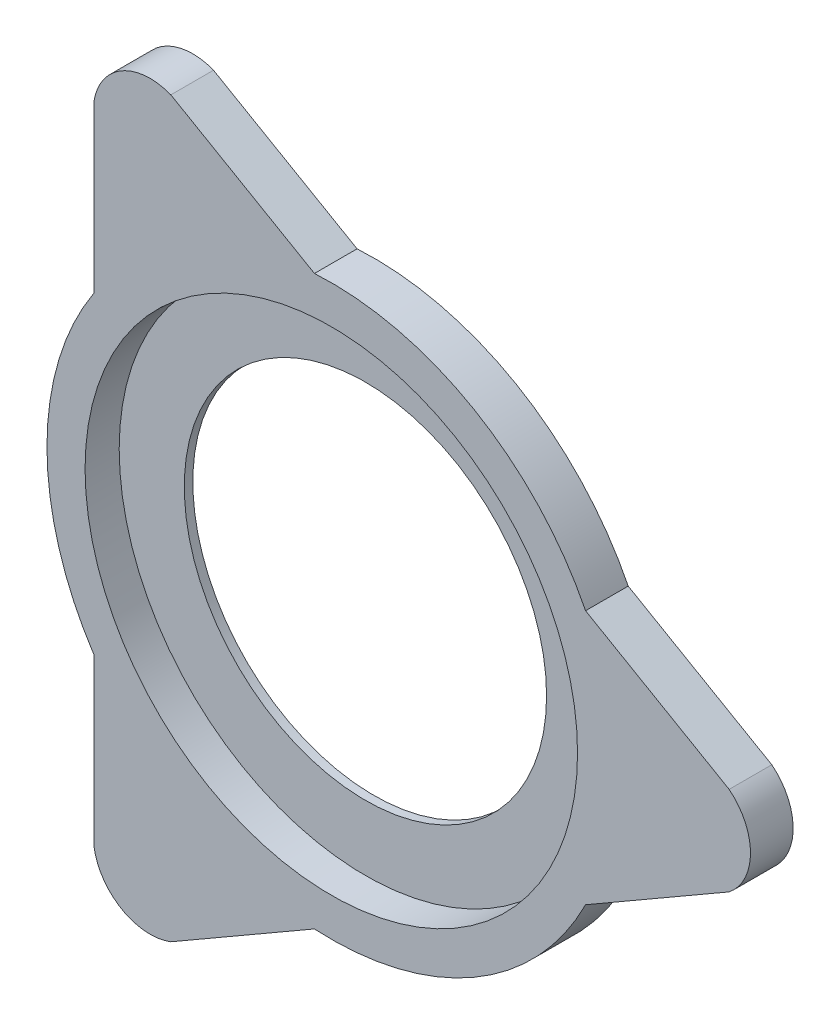
ISO-10303-21;
HEADER;
FILE_DESCRIPTION(('STEP AP214'),'2;1');
FILE_NAME('part.step','',(''),(''),'','','');
FILE_SCHEMA(('AUTOMOTIVE_DESIGN { 1 0 10303 214 1 1 1 1 }'));
ENDSEC;
DATA;
#1=APPLICATION_CONTEXT('core data for automotive mechanical design processes');
#2=APPLICATION_PROTOCOL_DEFINITION('international standard','automotive_design',2000,#1);
#3=PRODUCT_CONTEXT('',#1,'mechanical');
#4=PRODUCT('Part','Part','',(#3));
#5=PRODUCT_RELATED_PRODUCT_CATEGORY('part','',(#4));
#6=PRODUCT_DEFINITION_FORMATION('','',#4);
#7=PRODUCT_DEFINITION_CONTEXT('part definition',#1,'design');
#8=PRODUCT_DEFINITION('design','',#6,#7);
#9=PRODUCT_DEFINITION_SHAPE('','',#8);
#10=(LENGTH_UNIT() NAMED_UNIT(*) SI_UNIT(.MILLI.,.METRE.));
#11=(NAMED_UNIT(*) PLANE_ANGLE_UNIT() SI_UNIT($,.RADIAN.));
#12=(NAMED_UNIT(*) SI_UNIT($,.STERADIAN.) SOLID_ANGLE_UNIT());
#13=UNCERTAINTY_MEASURE_WITH_UNIT(LENGTH_MEASURE(1.E-05),#10,'distance_accuracy_value','');
#14=(GEOMETRIC_REPRESENTATION_CONTEXT(3) GLOBAL_UNCERTAINTY_ASSIGNED_CONTEXT((#13)) GLOBAL_UNIT_ASSIGNED_CONTEXT((#10,
#11,#12)) REPRESENTATION_CONTEXT('',''));
#15=CARTESIAN_POINT('',(0.,0.,0.));
#16=DIRECTION('',(0.,0.,1.));
#17=DIRECTION('',(1.,0.,0.));
#18=AXIS2_PLACEMENT_3D('',#15,#16,#17);
#19=CARTESIAN_POINT('',(0.,0.,9.525));
#20=DIRECTION('',(0.,0.,-1.));
#21=DIRECTION('',(-1.,0.,0.));
#22=AXIS2_PLACEMENT_3D('',#19,#20,#21);
#23=CYLINDRICAL_SURFACE('',#22,40.4563947467404);
#24=CARTESIAN_POINT('',(0.,0.,0.));
#25=DIRECTION('',(0.,0.,1.));
#26=DIRECTION('',(1.,0.,0.));
#27=AXIS2_PLACEMENT_3D('',#24,#25,#26);
#28=CIRCLE('',#27,40.4563947467404);
#29=CARTESIAN_POINT('',(40.4563947467404,0.,0.));
#30=VERTEX_POINT('',#29);
#31=EDGE_CURVE('E159',#30,#30,#28,.T.);
#32=ORIENTED_EDGE('',*,*,#31,.F.);
#33=EDGE_LOOP('',(#32));
#34=FACE_BOUND('',#33,.T.);
#35=CARTESIAN_POINT('',(0.,0.,1.905));
#36=DIRECTION('',(0.,0.,1.));
#37=DIRECTION('',(1.,0.,0.));
#38=AXIS2_PLACEMENT_3D('',#35,#36,#37);
#39=CIRCLE('',#38,40.4563947467404);
#40=CARTESIAN_POINT('',(40.4563947467404,0.,1.905));
#41=VERTEX_POINT('',#40);
#42=EDGE_CURVE('E37',#41,#41,#39,.T.);
#43=ORIENTED_EDGE('',*,*,#42,.T.);
#44=EDGE_LOOP('',(#43));
#45=FACE_BOUND('',#44,.T.);
#46=ADVANCED_FACE('F33',(#34,#45),#23,.F.);
#47=CARTESIAN_POINT('',(0.,0.,9.525));
#48=DIRECTION('',(0.,0.,1.));
#49=DIRECTION('',(1.,0.,0.));
#50=AXIS2_PLACEMENT_3D('',#47,#48,#49);
#51=PLANE('',#50);
#52=CARTESIAN_POINT('',(0.,0.,9.525));
#53=DIRECTION('',(0.,0.,1.));
#54=DIRECTION('',(1.,0.,0.));
#55=AXIS2_PLACEMENT_3D('',#52,#53,#54);
#56=CIRCLE('',#55,54.9919447217432);
#57=CARTESIAN_POINT('',(54.9919447217432,0.,9.525));
#58=VERTEX_POINT('',#57);
#59=EDGE_CURVE('E348',#58,#58,#56,.T.);
#60=ORIENTED_EDGE('',*,*,#59,.F.);
#61=EDGE_LOOP('',(#60));
#62=FACE_BOUND('',#61,.T.);
#63=CARTESIAN_POINT('',(0.,0.,9.525));
#64=DIRECTION('',(0.,0.,1.));
#65=DIRECTION('',(1.,0.,0.));
#66=AXIS2_PLACEMENT_3D('',#63,#64,#65);
#67=CIRCLE('',#66,63.5);
#68=CARTESIAN_POINT('',(56.7796058709401,28.4310808296257,9.525));
#69=VERTEX_POINT('',#68);
#70=CARTESIAN_POINT('',(-3.76776467996547,63.388121515915,9.525));
#71=VERTEX_POINT('',#70);
#72=EDGE_CURVE('E178',#69,#71,#67,.T.);
#73=ORIENTED_EDGE('',*,*,#72,.T.);
#74=DIRECTION('',(-0.866025403784439,0.5,0.));
#75=VECTOR('',#74,1.);
#76=CARTESIAN_POINT('',(-3.76776467996547,63.388121515915,9.525));
#77=LINE('',#76,#75);
#78=CARTESIAN_POINT('',(-35.8333840191295,81.9012154731134,9.525));
#79=VERTEX_POINT('',#78);
#80=EDGE_CURVE('E106',#71,#79,#77,.T.);
#81=ORIENTED_EDGE('',*,*,#80,.T.);
#82=CARTESIAN_POINT('',(-40.4563947467404,70.072531192417,9.525));
#83=DIRECTION('',(0.,0.,1.));
#84=DIRECTION('',(-1.,0.,0.));
#85=AXIS2_PLACEMENT_3D('',#82,#83,#84);
#86=CIRCLE('',#85,12.7);
#87=CARTESIAN_POINT('',(-53.0118411909746,71.983228600686,9.525));
#88=VERTEX_POINT('',#87);
#89=EDGE_CURVE('E206',#79,#88,#86,.T.);
#90=ORIENTED_EDGE('',*,*,#89,.T.);
#91=DIRECTION('',(0.,-1.,0.));
#92=VECTOR('',#91,1.);
#93=CARTESIAN_POINT('',(-53.0118411909746,71.983228600686,9.525));
#94=LINE('',#93,#92);
#95=CARTESIAN_POINT('',(-53.0118411909746,34.9570406862893,9.525));
#96=VERTEX_POINT('',#95);
#97=EDGE_CURVE('E225',#88,#96,#94,.T.);
#98=ORIENTED_EDGE('',*,*,#97,.T.);
#99=CARTESIAN_POINT('',(0.,0.,9.525));
#100=DIRECTION('',(0.,0.,1.));
#101=DIRECTION('',(1.,0.,0.));
#102=AXIS2_PLACEMENT_3D('',#99,#100,#101);
#103=CIRCLE('',#102,63.5);
#104=CARTESIAN_POINT('',(-53.0118411909746,-34.9570406862893,9.525));
#105=VERTEX_POINT('',#104);
#106=EDGE_CURVE('E222',#96,#105,#103,.T.);
#107=ORIENTED_EDGE('',*,*,#106,.T.);
#108=DIRECTION('',(0.,-1.,0.));
#109=VECTOR('',#108,1.);
#110=CARTESIAN_POINT('',(-53.0118411909746,-34.9570406862893,9.525));
#111=LINE('',#110,#109);
#112=CARTESIAN_POINT('',(-53.0118411909746,-71.9832286006861,9.525));
#113=VERTEX_POINT('',#112);
#114=EDGE_CURVE('E224',#105,#113,#111,.T.);
#115=ORIENTED_EDGE('',*,*,#114,.T.);
#116=CARTESIAN_POINT('',(-40.4563947467404,-70.072531192417,9.525));
#117=DIRECTION('',(0.,0.,1.));
#118=DIRECTION('',(-1.,0.,0.));
#119=AXIS2_PLACEMENT_3D('',#116,#117,#118);
#120=CIRCLE('',#119,12.7);
#121=CARTESIAN_POINT('',(-35.8333840191293,-81.9012154731134,9.525));
#122=VERTEX_POINT('',#121);
#123=EDGE_CURVE('E227',#113,#122,#120,.T.);
#124=ORIENTED_EDGE('',*,*,#123,.T.);
#125=DIRECTION('',(0.866025403784438,0.500000000000001,0.));
#126=VECTOR('',#125,1.);
#127=CARTESIAN_POINT('',(-3.76776467996543,-63.388121515915,9.525));
#128=LINE('',#127,#126);
#129=CARTESIAN_POINT('',(-3.76776467996544,-63.388121515915,9.525));
#130=VERTEX_POINT('',#129);
#131=EDGE_CURVE('E233',#122,#130,#128,.T.);
#132=ORIENTED_EDGE('',*,*,#131,.T.);
#133=CARTESIAN_POINT('',(0.,0.,9.525));
#134=DIRECTION('',(0.,0.,1.));
#135=DIRECTION('',(1.,0.,0.));
#136=AXIS2_PLACEMENT_3D('',#133,#134,#135);
#137=CIRCLE('',#136,63.5);
#138=CARTESIAN_POINT('',(56.7796058709401,-28.4310808296256,9.525));
#139=VERTEX_POINT('',#138);
#140=EDGE_CURVE('E137',#130,#139,#137,.T.);
#141=ORIENTED_EDGE('',*,*,#140,.T.);
#142=DIRECTION('',(0.866025403784438,0.500000000000001,0.));
#143=VECTOR('',#142,1.);
#144=CARTESIAN_POINT('',(88.8452252101041,-9.9179868724272,9.525));
#145=LINE('',#144,#143);
#146=CARTESIAN_POINT('',(88.8452252101041,-9.91798687242719,9.525));
#147=VERTEX_POINT('',#146);
#148=EDGE_CURVE('E131',#139,#147,#145,.T.);
#149=ORIENTED_EDGE('',*,*,#148,.T.);
#150=CARTESIAN_POINT('',(80.9127894934808,0.,9.525));
#151=DIRECTION('',(0.,0.,1.));
#152=DIRECTION('',(-1.,0.,0.));
#153=AXIS2_PLACEMENT_3D('',#150,#151,#152);
#154=CIRCLE('',#153,12.7);
#155=CARTESIAN_POINT('',(88.845225210104,9.91798687242733,9.525));
#156=VERTEX_POINT('',#155);
#157=EDGE_CURVE('E135',#147,#156,#154,.T.);
#158=ORIENTED_EDGE('',*,*,#157,.T.);
#159=DIRECTION('',(-0.866025403784439,0.5,0.));
#160=VECTOR('',#159,1.);
#161=CARTESIAN_POINT('',(88.845225210104,9.91798687242733,9.525));
#162=LINE('',#161,#160);
#163=EDGE_CURVE('E51',#156,#69,#162,.T.);
#164=ORIENTED_EDGE('',*,*,#163,.T.);
#165=EDGE_LOOP('',(#73,#81,#90,#98,#107,#115,#124,#132,#141,#149,#158,#164));
#166=FACE_BOUND('',#165,.T.);
#167=ADVANCED_FACE('F133',(#62,#166),#51,.T.);
#168=CARTESIAN_POINT('',(0.,0.,0.));
#169=DIRECTION('',(0.,0.,1.));
#170=DIRECTION('',(1.,0.,0.));
#171=AXIS2_PLACEMENT_3D('',#168,#169,#170);
#172=PLANE('',#171);
#173=CARTESIAN_POINT('',(0.,0.,0.));
#174=DIRECTION('',(0.,0.,1.));
#175=DIRECTION('',(1.,0.,0.));
#176=AXIS2_PLACEMENT_3D('',#173,#174,#175);
#177=CIRCLE('',#176,63.5);
#178=CARTESIAN_POINT('',(56.7796058709401,28.4310808296257,0.));
#179=VERTEX_POINT('',#178);
#180=CARTESIAN_POINT('',(-3.76776467996547,63.388121515915,0.));
#181=VERTEX_POINT('',#180);
#182=EDGE_CURVE('E155',#179,#181,#177,.T.);
#183=ORIENTED_EDGE('',*,*,#182,.F.);
#184=DIRECTION('',(-0.866025403784439,0.5,0.));
#185=VECTOR('',#184,1.);
#186=CARTESIAN_POINT('',(88.845225210104,9.91798687242733,0.));
#187=LINE('',#186,#185);
#188=CARTESIAN_POINT('',(88.845225210104,9.91798687242733,0.));
#189=VERTEX_POINT('',#188);
#190=EDGE_CURVE('E98',#189,#179,#187,.T.);
#191=ORIENTED_EDGE('',*,*,#190,.F.);
#192=CARTESIAN_POINT('',(80.9127894934808,0.,0.));
#193=DIRECTION('',(0.,0.,1.));
#194=DIRECTION('',(-1.,0.,0.));
#195=AXIS2_PLACEMENT_3D('',#192,#193,#194);
#196=CIRCLE('',#195,12.7);
#197=CARTESIAN_POINT('',(88.8452252101041,-9.91798687242719,0.));
#198=VERTEX_POINT('',#197);
#199=EDGE_CURVE('E92',#198,#189,#196,.T.);
#200=ORIENTED_EDGE('',*,*,#199,.F.);
#201=DIRECTION('',(0.866025403784438,0.500000000000001,0.));
#202=VECTOR('',#201,1.);
#203=CARTESIAN_POINT('',(88.8452252101041,-9.9179868724272,0.));
#204=LINE('',#203,#202);
#205=CARTESIAN_POINT('',(56.7796058709401,-28.4310808296256,0.));
#206=VERTEX_POINT('',#205);
#207=EDGE_CURVE('E145',#206,#198,#204,.T.);
#208=ORIENTED_EDGE('',*,*,#207,.F.);
#209=CARTESIAN_POINT('',(0.,0.,0.));
#210=DIRECTION('',(0.,0.,1.));
#211=DIRECTION('',(1.,0.,0.));
#212=AXIS2_PLACEMENT_3D('',#209,#210,#211);
#213=CIRCLE('',#212,63.5);
#214=CARTESIAN_POINT('',(-3.76776467996544,-63.388121515915,0.));
#215=VERTEX_POINT('',#214);
#216=EDGE_CURVE('E173',#215,#206,#213,.T.);
#217=ORIENTED_EDGE('',*,*,#216,.F.);
#218=DIRECTION('',(0.866025403784438,0.500000000000001,0.));
#219=VECTOR('',#218,1.);
#220=CARTESIAN_POINT('',(-3.76776467996543,-63.388121515915,0.));
#221=LINE('',#220,#219);
#222=CARTESIAN_POINT('',(-35.8333840191293,-81.9012154731134,0.));
#223=VERTEX_POINT('',#222);
#224=EDGE_CURVE('E171',#223,#215,#221,.T.);
#225=ORIENTED_EDGE('',*,*,#224,.F.);
#226=CARTESIAN_POINT('',(-40.4563947467404,-70.072531192417,0.));
#227=DIRECTION('',(0.,0.,1.));
#228=DIRECTION('',(-1.,0.,0.));
#229=AXIS2_PLACEMENT_3D('',#226,#227,#228);
#230=CIRCLE('',#229,12.7);
#231=CARTESIAN_POINT('',(-53.0118411909746,-71.9832286006861,0.));
#232=VERTEX_POINT('',#231);
#233=EDGE_CURVE('E169',#232,#223,#230,.T.);
#234=ORIENTED_EDGE('',*,*,#233,.F.);
#235=DIRECTION('',(0.,-1.,0.));
#236=VECTOR('',#235,1.);
#237=CARTESIAN_POINT('',(-53.0118411909746,-34.9570406862893,0.));
#238=LINE('',#237,#236);
#239=CARTESIAN_POINT('',(-53.0118411909746,-34.9570406862893,0.));
#240=VERTEX_POINT('',#239);
#241=EDGE_CURVE('E167',#240,#232,#238,.T.);
#242=ORIENTED_EDGE('',*,*,#241,.F.);
#243=CARTESIAN_POINT('',(0.,0.,0.));
#244=DIRECTION('',(0.,0.,1.));
#245=DIRECTION('',(1.,0.,0.));
#246=AXIS2_PLACEMENT_3D('',#243,#244,#245);
#247=CIRCLE('',#246,63.5);
#248=CARTESIAN_POINT('',(-53.0118411909746,34.9570406862893,0.));
#249=VERTEX_POINT('',#248);
#250=EDGE_CURVE('E165',#249,#240,#247,.T.);
#251=ORIENTED_EDGE('',*,*,#250,.F.);
#252=DIRECTION('',(0.,-1.,0.));
#253=VECTOR('',#252,1.);
#254=CARTESIAN_POINT('',(-53.0118411909746,71.983228600686,0.));
#255=LINE('',#254,#253);
#256=CARTESIAN_POINT('',(-53.0118411909746,71.983228600686,0.));
#257=VERTEX_POINT('',#256);
#258=EDGE_CURVE('E163',#257,#249,#255,.T.);
#259=ORIENTED_EDGE('',*,*,#258,.F.);
#260=CARTESIAN_POINT('',(-40.4563947467404,70.072531192417,0.));
#261=DIRECTION('',(0.,0.,1.));
#262=DIRECTION('',(-1.,0.,0.));
#263=AXIS2_PLACEMENT_3D('',#260,#261,#262);
#264=CIRCLE('',#263,12.7);
#265=CARTESIAN_POINT('',(-35.8333840191295,81.9012154731134,0.));
#266=VERTEX_POINT('',#265);
#267=EDGE_CURVE('E161',#266,#257,#264,.T.);
#268=ORIENTED_EDGE('',*,*,#267,.F.);
#269=DIRECTION('',(-0.866025403784439,0.5,0.));
#270=VECTOR('',#269,1.);
#271=CARTESIAN_POINT('',(-3.76776467996547,63.388121515915,0.));
#272=LINE('',#271,#270);
#273=EDGE_CURVE('E158',#181,#266,#272,.T.);
#274=ORIENTED_EDGE('',*,*,#273,.F.);
#275=EDGE_LOOP('',(#183,#191,#200,#208,#217,#225,#234,#242,#251,#259,#268,#274));
#276=FACE_BOUND('',#275,.T.);
#277=ORIENTED_EDGE('',*,*,#31,.T.);
#278=EDGE_LOOP('',(#277));
#279=FACE_BOUND('',#278,.T.);
#280=ADVANCED_FACE('F210',(#276,#279),#172,.F.);
#281=CARTESIAN_POINT('',(0.,0.,9.525));
#282=DIRECTION('',(0.,0.,-1.));
#283=DIRECTION('',(-1.,0.,0.));
#284=AXIS2_PLACEMENT_3D('',#281,#282,#283);
#285=CYLINDRICAL_SURFACE('',#284,63.5);
#286=ORIENTED_EDGE('',*,*,#182,.T.);
#287=DIRECTION('',(0.,0.,-1.));
#288=VECTOR('',#287,1.);
#289=CARTESIAN_POINT('',(-3.76776467996547,63.388121515915,9.525));
#290=LINE('',#289,#288);
#291=EDGE_CURVE('E11',#71,#181,#290,.T.);
#292=ORIENTED_EDGE('',*,*,#291,.F.);
#293=ORIENTED_EDGE('',*,*,#72,.F.);
#294=DIRECTION('',(0.,0.,-1.));
#295=VECTOR('',#294,1.);
#296=CARTESIAN_POINT('',(56.7796058709401,28.4310808296257,9.525));
#297=LINE('',#296,#295);
#298=EDGE_CURVE('E151',#69,#179,#297,.T.);
#299=ORIENTED_EDGE('',*,*,#298,.T.);
#300=EDGE_LOOP('',(#286,#292,#293,#299));
#301=FACE_BOUND('',#300,.T.);
#302=ADVANCED_FACE('F35',(#301),#285,.T.);
#303=CARTESIAN_POINT('',(-3.76776467996547,63.388121515915,9.525));
#304=DIRECTION('',(-0.5,-0.866025403784439,0.));
#305=DIRECTION('',(0.866025403784439,-0.5,0.));
#306=AXIS2_PLACEMENT_3D('',#303,#304,#305);
#307=PLANE('',#306);
#308=ORIENTED_EDGE('',*,*,#273,.T.);
#309=DIRECTION('',(0.,0.,-1.));
#310=VECTOR('',#309,1.);
#311=CARTESIAN_POINT('',(-35.8333840191295,81.9012154731134,9.525));
#312=LINE('',#311,#310);
#313=EDGE_CURVE('E43',#79,#266,#312,.T.);
#314=ORIENTED_EDGE('',*,*,#313,.F.);
#315=ORIENTED_EDGE('',*,*,#80,.F.);
#316=ORIENTED_EDGE('',*,*,#291,.T.);
#317=EDGE_LOOP('',(#308,#314,#315,#316));
#318=FACE_BOUND('',#317,.T.);
#319=ADVANCED_FACE('F275',(#318),#307,.F.);
#320=CARTESIAN_POINT('',(-40.4563947467404,70.072531192417,9.525));
#321=DIRECTION('',(0.,0.,-1.));
#322=DIRECTION('',(-1.,0.,0.));
#323=AXIS2_PLACEMENT_3D('',#320,#321,#322);
#324=CYLINDRICAL_SURFACE('',#323,12.7);
#325=ORIENTED_EDGE('',*,*,#267,.T.);
#326=DIRECTION('',(0.,0.,-1.));
#327=VECTOR('',#326,1.);
#328=CARTESIAN_POINT('',(-53.0118411909746,71.983228600686,9.525));
#329=LINE('',#328,#327);
#330=EDGE_CURVE('E197',#88,#257,#329,.T.);
#331=ORIENTED_EDGE('',*,*,#330,.F.);
#332=ORIENTED_EDGE('',*,*,#89,.F.);
#333=ORIENTED_EDGE('',*,*,#313,.T.);
#334=EDGE_LOOP('',(#325,#331,#332,#333));
#335=FACE_BOUND('',#334,.T.);
#336=ADVANCED_FACE('F204',(#335),#324,.T.);
#337=CARTESIAN_POINT('',(-53.0118411909746,71.983228600686,9.525));
#338=DIRECTION('',(1.,0.,0.));
#339=DIRECTION('',(0.,1.,0.));
#340=AXIS2_PLACEMENT_3D('',#337,#338,#339);
#341=PLANE('',#340);
#342=ORIENTED_EDGE('',*,*,#258,.T.);
#343=DIRECTION('',(0.,0.,-1.));
#344=VECTOR('',#343,1.);
#345=CARTESIAN_POINT('',(-53.0118411909746,34.9570406862893,9.525));
#346=LINE('',#345,#344);
#347=EDGE_CURVE('E194',#96,#249,#346,.T.);
#348=ORIENTED_EDGE('',*,*,#347,.F.);
#349=ORIENTED_EDGE('',*,*,#97,.F.);
#350=ORIENTED_EDGE('',*,*,#330,.T.);
#351=EDGE_LOOP('',(#342,#348,#349,#350));
#352=FACE_BOUND('',#351,.T.);
#353=ADVANCED_FACE('F216',(#352),#341,.F.);
#354=CARTESIAN_POINT('',(0.,0.,9.525));
#355=DIRECTION('',(0.,0.,-1.));
#356=DIRECTION('',(-1.,0.,0.));
#357=AXIS2_PLACEMENT_3D('',#354,#355,#356);
#358=CYLINDRICAL_SURFACE('',#357,63.5);
#359=ORIENTED_EDGE('',*,*,#250,.T.);
#360=DIRECTION('',(0.,0.,-1.));
#361=VECTOR('',#360,1.);
#362=CARTESIAN_POINT('',(-53.0118411909746,-34.9570406862893,9.525));
#363=LINE('',#362,#361);
#364=EDGE_CURVE('E191',#105,#240,#363,.T.);
#365=ORIENTED_EDGE('',*,*,#364,.F.);
#366=ORIENTED_EDGE('',*,*,#106,.F.);
#367=ORIENTED_EDGE('',*,*,#347,.T.);
#368=EDGE_LOOP('',(#359,#365,#366,#367));
#369=FACE_BOUND('',#368,.T.);
#370=ADVANCED_FACE('F220',(#369),#358,.T.);
#371=CARTESIAN_POINT('',(-53.0118411909746,-34.9570406862893,9.525));
#372=DIRECTION('',(1.,0.,0.));
#373=DIRECTION('',(0.,1.,0.));
#374=AXIS2_PLACEMENT_3D('',#371,#372,#373);
#375=PLANE('',#374);
#376=ORIENTED_EDGE('',*,*,#241,.T.);
#377=DIRECTION('',(0.,0.,-1.));
#378=VECTOR('',#377,1.);
#379=CARTESIAN_POINT('',(-53.0118411909746,-71.9832286006861,9.525));
#380=LINE('',#379,#378);
#381=EDGE_CURVE('E188',#113,#232,#380,.T.);
#382=ORIENTED_EDGE('',*,*,#381,.F.);
#383=ORIENTED_EDGE('',*,*,#114,.F.);
#384=ORIENTED_EDGE('',*,*,#364,.T.);
#385=EDGE_LOOP('',(#376,#382,#383,#384));
#386=FACE_BOUND('',#385,.T.);
#387=ADVANCED_FACE('F288',(#386),#375,.F.);
#388=CARTESIAN_POINT('',(-40.4563947467404,-70.072531192417,9.525));
#389=DIRECTION('',(0.,0.,-1.));
#390=DIRECTION('',(-1.,0.,0.));
#391=AXIS2_PLACEMENT_3D('',#388,#389,#390);
#392=CYLINDRICAL_SURFACE('',#391,12.7);
#393=ORIENTED_EDGE('',*,*,#233,.T.);
#394=DIRECTION('',(0.,0.,-1.));
#395=VECTOR('',#394,1.);
#396=CARTESIAN_POINT('',(-35.8333840191293,-81.9012154731134,9.525));
#397=LINE('',#396,#395);
#398=EDGE_CURVE('E185',#122,#223,#397,.T.);
#399=ORIENTED_EDGE('',*,*,#398,.F.);
#400=ORIENTED_EDGE('',*,*,#123,.F.);
#401=ORIENTED_EDGE('',*,*,#381,.T.);
#402=EDGE_LOOP('',(#393,#399,#400,#401));
#403=FACE_BOUND('',#402,.T.);
#404=ADVANCED_FACE('F291',(#403),#392,.T.);
#405=CARTESIAN_POINT('',(-3.76776467996543,-63.388121515915,9.525));
#406=DIRECTION('',(-0.500000000000001,0.866025403784438,0.));
#407=DIRECTION('',(-0.866025403784438,-0.500000000000001,0.));
#408=AXIS2_PLACEMENT_3D('',#405,#406,#407);
#409=PLANE('',#408);
#410=ORIENTED_EDGE('',*,*,#224,.T.);
#411=DIRECTION('',(0.,0.,-1.));
#412=VECTOR('',#411,1.);
#413=CARTESIAN_POINT('',(-3.76776467996544,-63.388121515915,9.525));
#414=LINE('',#413,#412);
#415=EDGE_CURVE('E182',#130,#215,#414,.T.);
#416=ORIENTED_EDGE('',*,*,#415,.F.);
#417=ORIENTED_EDGE('',*,*,#131,.F.);
#418=ORIENTED_EDGE('',*,*,#398,.T.);
#419=EDGE_LOOP('',(#410,#416,#417,#418));
#420=FACE_BOUND('',#419,.T.);
#421=ADVANCED_FACE('F239',(#420),#409,.F.);
#422=CARTESIAN_POINT('',(0.,0.,9.525));
#423=DIRECTION('',(0.,0.,-1.));
#424=DIRECTION('',(-1.,0.,0.));
#425=AXIS2_PLACEMENT_3D('',#422,#423,#424);
#426=CYLINDRICAL_SURFACE('',#425,63.5);
#427=ORIENTED_EDGE('',*,*,#216,.T.);
#428=DIRECTION('',(0.,0.,-1.));
#429=VECTOR('',#428,1.);
#430=CARTESIAN_POINT('',(56.7796058709401,-28.4310808296256,9.525));
#431=LINE('',#430,#429);
#432=EDGE_CURVE('E146',#139,#206,#431,.T.);
#433=ORIENTED_EDGE('',*,*,#432,.F.);
#434=ORIENTED_EDGE('',*,*,#140,.F.);
#435=ORIENTED_EDGE('',*,*,#415,.T.);
#436=EDGE_LOOP('',(#427,#433,#434,#435));
#437=FACE_BOUND('',#436,.T.);
#438=ADVANCED_FACE('F243',(#437),#426,.T.);
#439=CARTESIAN_POINT('',(88.8452252101041,-9.9179868724272,9.525));
#440=DIRECTION('',(-0.500000000000001,0.866025403784438,0.));
#441=DIRECTION('',(-0.866025403784438,-0.500000000000001,0.));
#442=AXIS2_PLACEMENT_3D('',#439,#440,#441);
#443=PLANE('',#442);
#444=ORIENTED_EDGE('',*,*,#207,.T.);
#445=DIRECTION('',(0.,0.,-1.));
#446=VECTOR('',#445,1.);
#447=CARTESIAN_POINT('',(88.8452252101041,-9.91798687242719,9.525));
#448=LINE('',#447,#446);
#449=EDGE_CURVE('E142',#147,#198,#448,.T.);
#450=ORIENTED_EDGE('',*,*,#449,.F.);
#451=ORIENTED_EDGE('',*,*,#148,.F.);
#452=ORIENTED_EDGE('',*,*,#432,.T.);
#453=EDGE_LOOP('',(#444,#450,#451,#452));
#454=FACE_BOUND('',#453,.T.);
#455=ADVANCED_FACE('F143',(#454),#443,.F.);
#456=CARTESIAN_POINT('',(80.9127894934808,0.,9.525));
#457=DIRECTION('',(0.,0.,-1.));
#458=DIRECTION('',(-1.,0.,0.));
#459=AXIS2_PLACEMENT_3D('',#456,#457,#458);
#460=CYLINDRICAL_SURFACE('',#459,12.7);
#461=ORIENTED_EDGE('',*,*,#199,.T.);
#462=DIRECTION('',(0.,0.,-1.));
#463=VECTOR('',#462,1.);
#464=CARTESIAN_POINT('',(88.845225210104,9.91798687242733,9.525));
#465=LINE('',#464,#463);
#466=EDGE_CURVE('E147',#156,#189,#465,.T.);
#467=ORIENTED_EDGE('',*,*,#466,.F.);
#468=ORIENTED_EDGE('',*,*,#157,.F.);
#469=ORIENTED_EDGE('',*,*,#449,.T.);
#470=EDGE_LOOP('',(#461,#467,#468,#469));
#471=FACE_BOUND('',#470,.T.);
#472=ADVANCED_FACE('F149',(#471),#460,.T.);
#473=CARTESIAN_POINT('',(88.845225210104,9.91798687242733,9.525));
#474=DIRECTION('',(-0.5,-0.866025403784439,0.));
#475=DIRECTION('',(0.866025403784439,-0.5,0.));
#476=AXIS2_PLACEMENT_3D('',#473,#474,#475);
#477=PLANE('',#476);
#478=ORIENTED_EDGE('',*,*,#190,.T.);
#479=ORIENTED_EDGE('',*,*,#298,.F.);
#480=ORIENTED_EDGE('',*,*,#163,.F.);
#481=ORIENTED_EDGE('',*,*,#466,.T.);
#482=EDGE_LOOP('',(#478,#479,#480,#481));
#483=FACE_BOUND('',#482,.T.);
#484=ADVANCED_FACE('F247',(#483),#477,.F.);
#485=CARTESIAN_POINT('',(0.,0.,1.905));
#486=DIRECTION('',(0.,0.,1.));
#487=DIRECTION('',(1.,0.,0.));
#488=AXIS2_PLACEMENT_3D('',#485,#486,#487);
#489=CYLINDRICAL_SURFACE('',#488,54.9919447217432);
#490=CARTESIAN_POINT('',(0.,0.,1.905));
#491=DIRECTION('',(0.,0.,1.));
#492=DIRECTION('',(1.,0.,0.));
#493=AXIS2_PLACEMENT_3D('',#490,#491,#492);
#494=CIRCLE('',#493,54.9919447217432);
#495=CARTESIAN_POINT('',(54.9919447217432,0.,1.905));
#496=VERTEX_POINT('',#495);
#497=EDGE_CURVE('E347',#496,#496,#494,.T.);
#498=ORIENTED_EDGE('',*,*,#497,.F.);
#499=EDGE_LOOP('',(#498));
#500=FACE_BOUND('',#499,.T.);
#501=ORIENTED_EDGE('',*,*,#59,.T.);
#502=EDGE_LOOP('',(#501));
#503=FACE_BOUND('',#502,.T.);
#504=ADVANCED_FACE('F249',(#500,#503),#489,.F.);
#505=CARTESIAN_POINT('',(0.,0.,1.905));
#506=DIRECTION('',(0.,0.,1.));
#507=DIRECTION('',(1.,0.,0.));
#508=AXIS2_PLACEMENT_3D('',#505,#506,#507);
#509=PLANE('',#508);
#510=ORIENTED_EDGE('',*,*,#42,.F.);
#511=EDGE_LOOP('',(#510));
#512=FACE_BOUND('',#511,.T.);
#513=ORIENTED_EDGE('',*,*,#497,.T.);
#514=EDGE_LOOP('',(#513));
#515=FACE_BOUND('',#514,.T.);
#516=ADVANCED_FACE('F255',(#512,#515),#509,.T.);
#517=CLOSED_SHELL('',(#46,#167,#280,#302,#319,#336,#353,#370,#387,#404,#421,#438,#455,#472,#484,
#504,#516));
#518=MANIFOLD_SOLID_BREP('B2',#517);
#519=ADVANCED_BREP_SHAPE_REPRESENTATION('',(#18,#518),#14);
#520=SHAPE_DEFINITION_REPRESENTATION(#9,#519);
ENDSEC;
END-ISO-10303-21;
